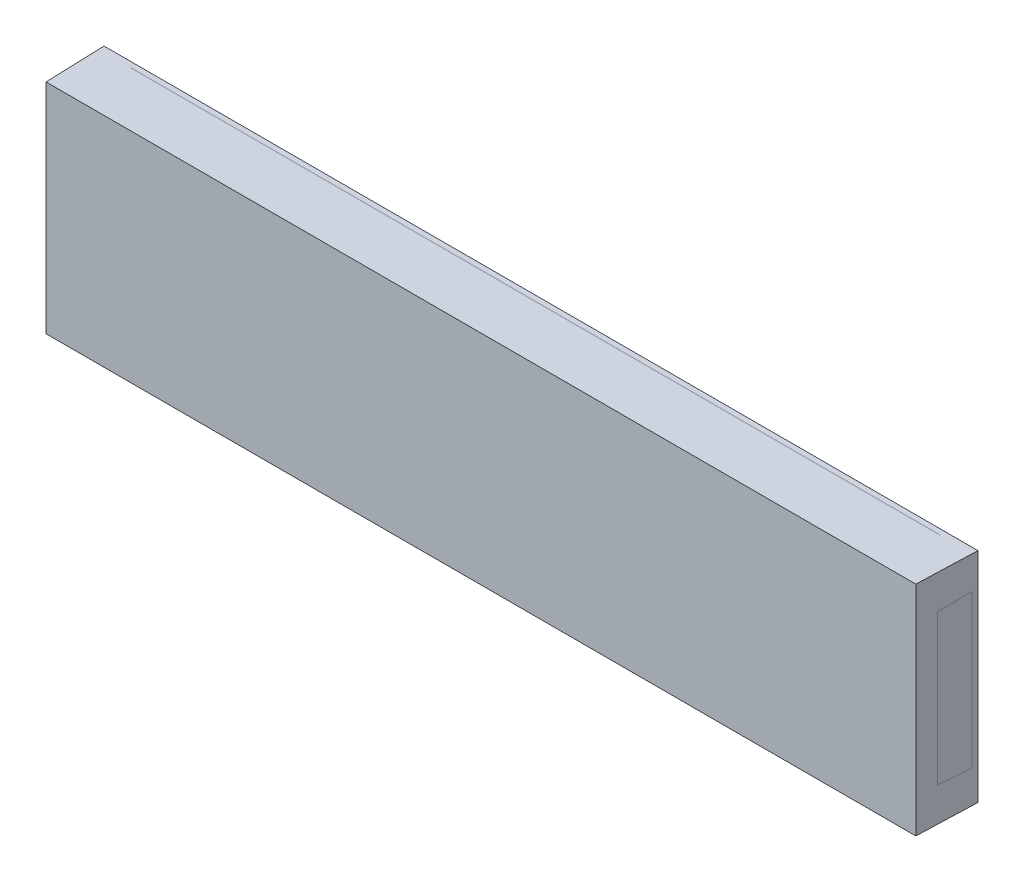
ISO-10303-21;
HEADER;
FILE_DESCRIPTION(('STEP AP214'),'2;1');
FILE_NAME('part.step','',(''),(''),'','','');
FILE_SCHEMA(('AUTOMOTIVE_DESIGN { 1 0 10303 214 1 1 1 1 }'));
ENDSEC;
DATA;
#1=APPLICATION_CONTEXT('core data for automotive mechanical design processes');
#2=APPLICATION_PROTOCOL_DEFINITION('international standard','automotive_design',2000,#1);
#3=PRODUCT_CONTEXT('',#1,'mechanical');
#4=PRODUCT('Part','Part','',(#3));
#5=PRODUCT_RELATED_PRODUCT_CATEGORY('part','',(#4));
#6=PRODUCT_DEFINITION_FORMATION('','',#4);
#7=PRODUCT_DEFINITION_CONTEXT('part definition',#1,'design');
#8=PRODUCT_DEFINITION('design','',#6,#7);
#9=PRODUCT_DEFINITION_SHAPE('','',#8);
#10=(LENGTH_UNIT() NAMED_UNIT(*) SI_UNIT(.MILLI.,.METRE.));
#11=(NAMED_UNIT(*) PLANE_ANGLE_UNIT() SI_UNIT($,.RADIAN.));
#12=(NAMED_UNIT(*) SI_UNIT($,.STERADIAN.) SOLID_ANGLE_UNIT());
#13=UNCERTAINTY_MEASURE_WITH_UNIT(LENGTH_MEASURE(1.E-05),#10,'distance_accuracy_value','');
#14=(GEOMETRIC_REPRESENTATION_CONTEXT(3) GLOBAL_UNCERTAINTY_ASSIGNED_CONTEXT((#13)) GLOBAL_UNIT_ASSIGNED_CONTEXT((#10,
#11,#12)) REPRESENTATION_CONTEXT('',''));
#15=CARTESIAN_POINT('',(0.,0.,0.));
#16=DIRECTION('',(0.,0.,1.));
#17=DIRECTION('',(1.,0.,0.));
#18=AXIS2_PLACEMENT_3D('',#15,#16,#17);
#19=CARTESIAN_POINT('',(40.,-10.,0.));
#20=DIRECTION('',(0.,0.,-1.));
#21=DIRECTION('',(-1.,0.,0.));
#22=AXIS2_PLACEMENT_3D('',#19,#20,#21);
#23=PLANE('',#22);
#24=DIRECTION('',(0.,-1.,0.));
#25=VECTOR('',#24,1.);
#26=CARTESIAN_POINT('',(40.0000009070112,9.98192948673217,0.));
#27=LINE('',#26,#25);
#28=CARTESIAN_POINT('',(40.0000009070112,9.98192948673217,0.));
#29=VERTEX_POINT('',#28);
#30=CARTESIAN_POINT('',(40.0000009070112,-9.98192980623829,0.));
#31=VERTEX_POINT('',#30);
#32=EDGE_CURVE('E150',#29,#31,#27,.T.);
#33=ORIENTED_EDGE('',*,*,#32,.T.);
#34=DIRECTION('',(-1.,0.,0.));
#35=VECTOR('',#34,1.);
#36=CARTESIAN_POINT('',(-40.0000005460726,-9.98192980623829,0.));
#37=LINE('',#36,#35);
#38=CARTESIAN_POINT('',(-40.0000005460726,-9.98192980623829,0.));
#39=VERTEX_POINT('',#38);
#40=EDGE_CURVE('E140',#31,#39,#37,.T.);
#41=ORIENTED_EDGE('',*,*,#40,.T.);
#42=DIRECTION('',(0.,-1.,0.));
#43=VECTOR('',#42,1.);
#44=CARTESIAN_POINT('',(-40.0000005460726,9.98192948673217,0.));
#45=LINE('',#44,#43);
#46=CARTESIAN_POINT('',(-40.0000005460726,9.98192948673217,0.));
#47=VERTEX_POINT('',#46);
#48=EDGE_CURVE('E136',#47,#39,#45,.T.);
#49=ORIENTED_EDGE('',*,*,#48,.F.);
#50=DIRECTION('',(-1.,0.,0.));
#51=VECTOR('',#50,1.);
#52=CARTESIAN_POINT('',(-40.0000005460726,9.98192948673217,0.));
#53=LINE('',#52,#51);
#54=EDGE_CURVE('E147',#29,#47,#53,.T.);
#55=ORIENTED_EDGE('',*,*,#54,.F.);
#56=EDGE_LOOP('',(#33,#41,#49,#55));
#57=FACE_BOUND('',#56,.T.);
#58=ADVANCED_FACE('F16',(#57),#23,.T.);
#59=CARTESIAN_POINT('',(40.0000009070112,9.98192948673217,0.));
#60=DIRECTION('',(-0.999390736977359,0.,-0.0349020750651221));
#61=DIRECTION('',(-0.0349020750651221,0.,0.999390736977359));
#62=AXIS2_PLACEMENT_3D('',#59,#60,#61);
#63=PLANE('',#62);
#64=DIRECTION('',(0.,-1.,0.));
#65=VECTOR('',#64,1.);
#66=CARTESIAN_POINT('',(39.8079224678627,9.98192948673217,5.5));
#67=LINE('',#66,#65);
#68=CARTESIAN_POINT('',(39.8079224678627,9.98192948673217,5.5));
#69=VERTEX_POINT('',#68);
#70=CARTESIAN_POINT('',(39.8079224678627,-9.98192980623829,5.5));
#71=VERTEX_POINT('',#70);
#72=EDGE_CURVE('E121',#69,#71,#67,.T.);
#73=ORIENTED_EDGE('',*,*,#72,.T.);
#74=DIRECTION('',(0.0349020750651221,0.,-0.999390736977359));
#75=VECTOR('',#74,1.);
#76=CARTESIAN_POINT('',(40.0000009070112,-9.98192980623829,0.));
#77=LINE('',#76,#75);
#78=EDGE_CURVE('E131',#71,#31,#77,.T.);
#79=ORIENTED_EDGE('',*,*,#78,.T.);
#80=ORIENTED_EDGE('',*,*,#32,.F.);
#81=DIRECTION('',(0.0349020750651221,0.,-0.999390736977359));
#82=VECTOR('',#81,1.);
#83=CARTESIAN_POINT('',(40.0000009070112,9.98192948673217,0.));
#84=LINE('',#83,#82);
#85=EDGE_CURVE('E145',#69,#29,#84,.T.);
#86=ORIENTED_EDGE('',*,*,#85,.F.);
#87=EDGE_LOOP('',(#73,#79,#80,#86));
#88=FACE_BOUND('',#87,.T.);
#89=DIRECTION('',(-0.0348782627420508,-0.0348782630061542,0.998782765949518));
#90=VECTOR('',#89,1.);
#91=CARTESIAN_POINT('',(39.9819302566142,6.983757775551,0.517449748351254));
#92=LINE('',#91,#90);
#93=CARTESIAN_POINT('',(39.9819298275343,6.98375777555006,0.517449733367464));
#94=VERTEX_POINT('',#93);
#95=CARTESIAN_POINT('',(39.8753315689852,6.87716738913,3.56979868319547));
#96=VERTEX_POINT('',#95);
#97=EDGE_CURVE('E310',#94,#96,#92,.T.);
#98=ORIENTED_EDGE('',*,*,#97,.F.);
#99=DIRECTION('',(0.,1.,0.));
#100=VECTOR('',#99,1.);
#101=CARTESIAN_POINT('',(39.9819302566096,-7.143998569056,0.51744974835109));
#102=LINE('',#101,#100);
#103=CARTESIAN_POINT('',(39.9819299970502,-6.98375777554963,0.517451030040159));
#104=VERTEX_POINT('',#103);
#105=EDGE_CURVE('E448',#94,#104,#102,.F.);
#106=ORIENTED_EDGE('',*,*,#105,.T.);
#107=DIRECTION('',(0.0348782627423749,-0.0348782627423707,-0.998782765958718));
#108=VECTOR('',#107,1.);
#109=CARTESIAN_POINT('',(39.8753398722184,-6.87716739116146,3.5697989934351));
#110=LINE('',#109,#108);
#111=CARTESIAN_POINT('',(39.8753315687993,-6.87716738945503,3.56979868320406));
#112=VERTEX_POINT('',#111);
#113=EDGE_CURVE('E298',#104,#112,#110,.F.);
#114=ORIENTED_EDGE('',*,*,#113,.T.);
#115=DIRECTION('',(0.,1.,0.));
#116=VECTOR('',#115,1.);
#117=CARTESIAN_POINT('',(39.8753398722194,-12.05849268302,3.56979899340661));
#118=LINE('',#117,#116);
#119=EDGE_CURVE('E302',#96,#112,#118,.F.);
#120=ORIENTED_EDGE('',*,*,#119,.F.);
#121=EDGE_LOOP('',(#98,#106,#114,#120));
#122=FACE_BOUND('',#121,.T.);
#123=ADVANCED_FACE('F180',(#88,#122),#63,.F.);
#124=CARTESIAN_POINT('',(-40.0000005460726,9.98192948673217,0.));
#125=DIRECTION('',(0.999390740500121,0.,-0.0349019741937438));
#126=DIRECTION('',(-0.0349019741937438,0.,-0.999390740500121));
#127=AXIS2_PLACEMENT_3D('',#124,#125,#126);
#128=PLANE('',#127);
#129=ORIENTED_EDGE('',*,*,#48,.T.);
#130=DIRECTION('',(0.0349019741937438,0.,0.999390740500121));
#131=VECTOR('',#130,1.);
#132=CARTESIAN_POINT('',(-40.0000005460726,-9.98192980623829,0.));
#133=LINE('',#132,#131);
#134=CARTESIAN_POINT('',(-39.8079226627318,-9.98192980623829,5.5));
#135=VERTEX_POINT('',#134);
#136=EDGE_CURVE('E128',#39,#135,#133,.T.);
#137=ORIENTED_EDGE('',*,*,#136,.T.);
#138=DIRECTION('',(0.,-1.,0.));
#139=VECTOR('',#138,1.);
#140=CARTESIAN_POINT('',(-39.8079226627318,9.98192948673217,5.5));
#141=LINE('',#140,#139);
#142=CARTESIAN_POINT('',(-39.8079226627318,9.98192948673217,5.5));
#143=VERTEX_POINT('',#142);
#144=EDGE_CURVE('E111',#143,#135,#141,.T.);
#145=ORIENTED_EDGE('',*,*,#144,.F.);
#146=DIRECTION('',(0.0349019741937438,0.,0.999390740500121));
#147=VECTOR('',#146,1.);
#148=CARTESIAN_POINT('',(-40.0000005460726,9.98192948673217,0.));
#149=LINE('',#148,#147);
#150=EDGE_CURVE('E142',#47,#143,#149,.T.);
#151=ORIENTED_EDGE('',*,*,#150,.F.);
#152=EDGE_LOOP('',(#129,#137,#145,#151));
#153=FACE_BOUND('',#152,.T.);
#154=DIRECTION('',(0.034878262742053,0.0348782630061543,0.998782765949518));
#155=VECTOR('',#154,1.);
#156=CARTESIAN_POINT('',(-39.9819302566142,-6.98375777555101,0.517449748351046));
#157=LINE('',#156,#155);
#158=CARTESIAN_POINT('',(-39.9819298990477,-6.98375777555227,0.517449735864835));
#159=VERTEX_POINT('',#158);
#160=CARTESIAN_POINT('',(-39.8753315689887,-6.87716738929246,3.56979868320128));
#161=VERTEX_POINT('',#160);
#162=EDGE_CURVE('E301',#159,#161,#157,.T.);
#163=ORIENTED_EDGE('',*,*,#162,.F.);
#164=DIRECTION('',(0.,-1.,0.));
#165=VECTOR('',#164,1.);
#166=CARTESIAN_POINT('',(-39.9819302566096,7.143998569056,0.51744974835109));
#167=LINE('',#166,#165);
#168=CARTESIAN_POINT('',(-39.9819298446761,6.98375777554657,0.517450974221577));
#169=VERTEX_POINT('',#168);
#170=EDGE_CURVE('E269',#159,#169,#167,.F.);
#171=ORIENTED_EDGE('',*,*,#170,.T.);
#172=DIRECTION('',(0.0348782627423707,-0.0348782627423707,0.998782765958719));
#173=VECTOR('',#172,1.);
#174=CARTESIAN_POINT('',(-40.0041157861973,7.00594330513268,-0.117860695936495));
#175=LINE('',#174,#173);
#176=CARTESIAN_POINT('',(-39.8753315687961,6.87716738923162,3.56979868319541));
#177=VERTEX_POINT('',#176);
#178=EDGE_CURVE('E207',#169,#177,#175,.T.);
#179=ORIENTED_EDGE('',*,*,#178,.T.);
#180=DIRECTION('',(0.,1.,0.));
#181=VECTOR('',#180,1.);
#182=CARTESIAN_POINT('',(-39.8753398722194,-11.05849268302,3.56979899340661));
#183=LINE('',#182,#181);
#184=EDGE_CURVE('E306',#161,#177,#183,.T.);
#185=ORIENTED_EDGE('',*,*,#184,.F.);
#186=EDGE_LOOP('',(#163,#171,#179,#185));
#187=FACE_BOUND('',#186,.T.);
#188=ADVANCED_FACE('F133',(#153,#187),#128,.F.);
#189=CARTESIAN_POINT('',(-39.8079226627318,-9.98192980623829,5.5));
#190=DIRECTION('',(0.,1.,0.));
#191=DIRECTION('',(0.,0.,1.));
#192=AXIS2_PLACEMENT_3D('',#189,#190,#191);
#193=PLANE('',#192);
#194=ORIENTED_EDGE('',*,*,#136,.F.);
#195=ORIENTED_EDGE('',*,*,#40,.F.);
#196=ORIENTED_EDGE('',*,*,#78,.F.);
#197=DIRECTION('',(1.,0.,0.));
#198=VECTOR('',#197,1.);
#199=CARTESIAN_POINT('',(-39.8079226627318,-9.98192980623829,5.5));
#200=LINE('',#199,#198);
#201=EDGE_CURVE('E114',#135,#71,#200,.T.);
#202=ORIENTED_EDGE('',*,*,#201,.F.);
#203=EDGE_LOOP('',(#194,#195,#196,#202));
#204=FACE_BOUND('',#203,.T.);
#205=CARTESIAN_POINT('',(36.98375777556,-9.482234843105,0.5));
#206=DIRECTION('',(1.,0.,0.));
#207=DIRECTION('',(0.,0.,-1.));
#208=AXIS2_PLACEMENT_3D('',#205,#206,#207);
#209=CIRCLE('',#208,0.5);
#210=CARTESIAN_POINT('',(36.98375777556,-9.98192980623829,0.482537359328566));
#211=VERTEX_POINT('',#210);
#212=CARTESIAN_POINT('',(36.9837577755424,-9.98192980623829,0.482601995474424));
#213=VERTEX_POINT('',#212);
#214=EDGE_CURVE('E214',#211,#213,#209,.F.);
#215=ORIENTED_EDGE('',*,*,#214,.F.);
#216=DIRECTION('',(1.,0.,0.));
#217=VECTOR('',#216,1.);
#218=CARTESIAN_POINT('',(-37.13223918574,-9.98192980623829,0.482537359328566));
#219=LINE('',#218,#217);
#220=CARTESIAN_POINT('',(-36.9837577755419,-9.98192980623828,0.482603656701612));
#221=VERTEX_POINT('',#220);
#222=EDGE_CURVE('E42',#221,#211,#219,.T.);
#223=ORIENTED_EDGE('',*,*,#222,.F.);
#224=CARTESIAN_POINT('',(-36.9837577755416,-9.9819298062383,0.517396343296493));
#225=CARTESIAN_POINT('',(-36.9879536992052,-9.981929806239,0.517359145028784));
#226=CARTESIAN_POINT('',(-36.9921880439902,-9.98192980623865,0.517132366181378));
#227=CARTESIAN_POINT('',(-37.0008153292392,-9.98192980623791,0.516066643000893));
#228=CARTESIAN_POINT('',(-37.0052038753618,-9.98192980623751,0.515194134539367));
#229=CARTESIAN_POINT('',(-37.0115480550821,-9.98192980623867,0.513229748609068));
#230=CARTESIAN_POINT('',(-37.0136044809461,-9.98192980623934,0.512475891201816));
#231=CARTESIAN_POINT('',(-37.0175596918098,-9.98192980623725,0.510667678451077));
#232=CARTESIAN_POINT('',(-37.0194601302562,-9.98192980623452,0.509617209916807));
#233=CARTESIAN_POINT('',(-37.0224598498217,-9.98192980623985,0.507368973921456));
#234=CARTESIAN_POINT('',(-37.0236369466024,-9.98192980624519,0.506287412802017));
#235=CARTESIAN_POINT('',(-37.0251556833245,-9.98192980623401,0.504223579317234));
#236=CARTESIAN_POINT('',(-37.0256448520456,-9.98192980622502,0.50335940997722));
#237=CARTESIAN_POINT('',(-37.0262352371623,-9.9819298062257,0.50164715647342));
#238=CARTESIAN_POINT('',(-37.0263847322471,-9.98192980623271,0.500817232723045));
#239=CARTESIAN_POINT('',(-37.0263818449234,-9.98192980623925,0.499156876247959));
#240=CARTESIAN_POINT('',(-37.026229056984,-9.98192980623878,0.498326444335675));
#241=CARTESIAN_POINT('',(-37.0256044028967,-9.98192980623597,0.496534705696169));
#242=CARTESIAN_POINT('',(-37.0250543108819,-9.98192980623315,0.495603108580127));
#243=CARTESIAN_POINT('',(-37.0233386075342,-9.98192980623134,0.493381512215582));
#244=CARTESIAN_POINT('',(-37.0220036320313,-9.98192980623592,0.492236321463049));
#245=CARTESIAN_POINT('',(-37.0176648973259,-9.98192980624313,0.489193110897724));
#246=CARTESIAN_POINT('',(-37.0143744995123,-9.98192980623872,0.487758103644763));
#247=CARTESIAN_POINT('',(-37.0071670633342,-9.98192980623776,0.485331320538807));
#248=CARTESIAN_POINT('',(-37.003226272153,-9.98192980624237,0.484428221094408));
#249=CARTESIAN_POINT('',(-36.9952565396089,-9.98192980623421,0.483159181494896));
#250=CARTESIAN_POINT('',(-36.9912275770333,-9.98192980622142,0.482793372077379));
#251=CARTESIAN_POINT('',(-36.9860490908079,-9.98192980622947,0.482623252648921));
#252=CARTESIAN_POINT('',(-36.9849031343206,-9.98192980623279,0.482604446408487));
#253=CARTESIAN_POINT('',(-36.9837577755419,-9.98192980623828,0.482603656701612));
#254=B_SPLINE_CURVE_WITH_KNOTS('',3,(#224,#225,#226,#227,#228,#229,#230,#231,#232,#233,#234,
#235,#236,#237,#238,#239,#240,#241,#242,#243,#244,#245,#246,#247,#248,#249,#250,#251,#252,#253),
.UNSPECIFIED.,.F.,.F.,(4,2,2,2,2,2,2,2,2,2,2,2,2,2,4),(0.,0.0126506526769451,0.026009613400871,
0.0325651144022979,0.0390384090145389,0.0437652146901737,0.0466980901597976,0.0491776303123396,
0.0516604991735108,0.0548477645750427,0.0600463293828571,0.0706746747000172,0.0827720380602645,
0.0948723445578345,0.0983097796420737),.UNSPECIFIED.);
#255=CARTESIAN_POINT('',(-36.9837575503598,-9.98192980623829,0.517446068710582));
#256=VERTEX_POINT('',#255);
#257=EDGE_CURVE('E11',#256,#221,#254,.T.);
#258=ORIENTED_EDGE('',*,*,#257,.F.);
#259=CARTESIAN_POINT('',(-36.9837577755472,-9.98192980623829,0.51746264543171));
#260=DIRECTION('',(1.,0.,0.));
#261=VECTOR('',#260,1.);
#262=LINE('',#259,#261);
#263=CARTESIAN_POINT('',(36.9837577755777,-9.98192980623829,0.517446484019595));
#264=VERTEX_POINT('',#263);
#265=EDGE_CURVE('E267',#256,#264,#262,.T.);
#266=ORIENTED_EDGE('',*,*,#265,.T.);
#267=CARTESIAN_POINT('',(36.9837577755424,-9.98192980623829,0.482601995474424));
#268=CARTESIAN_POINT('',(36.9879539585459,-9.98192980623906,0.482639314473691));
#269=CARTESIAN_POINT('',(36.9921885707566,-9.98192980623869,0.482866214058226));
#270=CARTESIAN_POINT('',(37.0008165048204,-9.98192980623787,0.48393224767878));
#271=CARTESIAN_POINT('',(37.0052054287384,-9.98192980623743,0.484804966313812));
#272=CARTESIAN_POINT('',(37.0115500938721,-9.98192980623871,0.486769781695058));
#273=CARTESIAN_POINT('',(37.0136066613852,-9.98192980623945,0.487523796197029));
#274=CARTESIAN_POINT('',(37.0175620968247,-9.98192980623714,0.489332382959601));
#275=CARTESIAN_POINT('',(37.0194626198199,-9.98192980623415,0.490383064902244));
#276=CARTESIAN_POINT('',(37.0224619927173,-9.98192980623993,0.492631509829533));
#277=CARTESIAN_POINT('',(37.0236387462876,-9.98192980624575,0.493712966407927));
#278=CARTESIAN_POINT('',(37.0251572036248,-9.98192980623366,0.495776712557232));
#279=CARTESIAN_POINT('',(37.0256463410093,-9.98192980622391,0.496640990976075));
#280=CARTESIAN_POINT('',(37.0262366052754,-9.98192980622469,0.498353417722306));
#281=CARTESIAN_POINT('',(37.0263860241147,-9.98192980623231,0.499183406232864));
#282=CARTESIAN_POINT('',(37.0263829772391,-9.98192980623935,0.50084385834695));
#283=CARTESIAN_POINT('',(37.0262301067085,-9.98192980623875,0.501674321096648));
#284=CARTESIAN_POINT('',(37.0256052451333,-9.98192980623603,0.503466232856195));
#285=CARTESIAN_POINT('',(37.0250549879647,-9.98192980623351,0.504397950266438));
#286=CARTESIAN_POINT('',(37.0233387759446,-9.98192980623196,0.506619890786136));
#287=CARTESIAN_POINT('',(37.022003417162,-9.98192980623612,0.507765249963665));
#288=CARTESIAN_POINT('',(37.0176633634804,-9.98192980624273,0.510808970744666));
#289=CARTESIAN_POINT('',(37.0143719753573,-9.98192980623884,0.512244164551787));
#290=CARTESIAN_POINT('',(37.0071624541636,-9.98192980623765,0.514671157967108));
#291=CARTESIAN_POINT('',(37.0032205696114,-9.98192980624133,0.515574264463217));
#292=CARTESIAN_POINT('',(36.9952486608407,-9.98192980623525,0.516843143012467));
#293=CARTESIAN_POINT('',(36.9912186156419,-9.98192980622548,0.517208785717119));
#294=CARTESIAN_POINT('',(36.9860424088419,-9.9819298062316,0.517378461070729));
#295=CARTESIAN_POINT('',(36.9848997955068,-9.98192980623412,0.517397188669165));
#296=CARTESIAN_POINT('',(36.9837577755423,-9.98192980623828,0.517398004525621));
#297=B_SPLINE_CURVE_WITH_KNOTS('',3,(#267,#268,#269,#270,#271,#272,#273,#274,#275,#276,#277,
#278,#279,#280,#281,#282,#283,#284,#285,#286,#287,#288,#289,#290,#291,#292,#293,#294,#295,#296),
.UNSPECIFIED.,.F.,.F.,(4,2,2,2,2,2,2,2,2,2,2,2,2,2,4),(0.,0.0126514582531855,0.0260116359008564,
0.0325676974934914,0.0390414895645643,0.0437673594863788,0.0467004601114489,0.0491801469257807,
0.0516631567025663,0.0548509759716014,0.0600507283915511,0.0706819855851187,0.0827825448207556,
0.0948860157556726,0.098313426861432),.UNSPECIFIED.);
#298=EDGE_CURVE('E450',#213,#264,#297,.T.);
#299=ORIENTED_EDGE('',*,*,#298,.F.);
#300=EDGE_LOOP('',(#215,#223,#258,#266,#299));
#301=FACE_BOUND('',#300,.T.);
#302=ADVANCED_FACE('F126',(#204,#301),#193,.F.);
#303=CARTESIAN_POINT('',(-39.8079226627318,9.98192948673217,5.5));
#304=DIRECTION('',(0.,1.,0.));
#305=DIRECTION('',(0.,0.,1.));
#306=AXIS2_PLACEMENT_3D('',#303,#304,#305);
#307=PLANE('',#306);
#308=DIRECTION('',(-1.,0.,0.));
#309=VECTOR('',#308,1.);
#310=CARTESIAN_POINT('',(37.14399856906,9.98192948673217,0.482528219028539));
#311=LINE('',#310,#309);
#312=CARTESIAN_POINT('',(-36.9837577755424,9.98192948673216,0.482592821187906));
#313=VERTEX_POINT('',#312);
#314=CARTESIAN_POINT('',(36.98375777555,9.98192948673217,0.482528219028539));
#315=VERTEX_POINT('',#314);
#316=EDGE_CURVE('E120',#313,#315,#311,.F.);
#317=ORIENTED_EDGE('',*,*,#316,.T.);
#318=CARTESIAN_POINT('',(36.9837577755419,9.98192948673217,0.482594481539302));
#319=CARTESIAN_POINT('',(36.9879570931712,9.98192948673295,0.482631767339016));
#320=CARTESIAN_POINT('',(36.9921949652236,9.98192948673257,0.482858768216633));
#321=CARTESIAN_POINT('',(37.0008306371648,9.98192948673175,0.483925826246428));
#322=CARTESIAN_POINT('',(37.0052240121718,9.9819294867313,0.484799671681216));
#323=CARTESIAN_POINT('',(37.0115746804303,9.9819294867326,0.486767402064617));
#324=CARTESIAN_POINT('',(37.0136330637292,9.98192948673334,0.487522543976));
#325=CARTESIAN_POINT('',(37.0175916335043,9.98192948673102,0.489334014879392));
#326=CARTESIAN_POINT('',(37.0194934895111,9.981929486728,0.490386419868195));
#327=CARTESIAN_POINT('',(37.0224903113036,9.98192948673381,0.492636256539395));
#328=CARTESIAN_POINT('',(37.023664034119,9.98192948673963,0.493716347714592));
#329=CARTESIAN_POINT('',(37.0251802819764,9.98192948672753,0.495778617013087));
#330=CARTESIAN_POINT('',(37.0256693039186,9.98192948671774,0.496643611530589));
#331=CARTESIAN_POINT('',(37.0262588335264,9.98192948671853,0.498357059775255));
#332=CARTESIAN_POINT('',(37.0264077765049,9.98192948672619,0.499187333658448));
#333=CARTESIAN_POINT('',(37.0264037750787,9.98192948673324,0.500848154025929));
#334=CARTESIAN_POINT('',(37.0262504302047,9.98192948673263,0.501678699412443));
#335=CARTESIAN_POINT('',(37.0256244064379,9.98192948672989,0.503471429270261));
#336=CARTESIAN_POINT('',(37.0250732301796,9.98192948672737,0.50440375434129));
#337=CARTESIAN_POINT('',(37.0233541980745,9.98192948672582,0.506627468630404));
#338=CARTESIAN_POINT('',(37.0220167254179,9.98192948673,0.507773684173941));
#339=CARTESIAN_POINT('',(37.0176694082882,9.98192948673662,0.510820012446086));
#340=CARTESIAN_POINT('',(37.0143725902835,9.98192948673271,0.512256103412539));
#341=CARTESIAN_POINT('',(37.007151690647,9.98192948673154,0.514683967681106));
#342=CARTESIAN_POINT('',(37.0032038694638,9.98192948673527,0.515586962687655));
#343=CARTESIAN_POINT('',(36.9952201589774,9.98192948672907,0.516854673162532));
#344=CARTESIAN_POINT('',(36.9911842497262,9.98192948671912,0.51721926539545));
#345=CARTESIAN_POINT('',(36.9860156635712,9.98192948672544,0.517386493167421));
#346=CARTESIAN_POINT('',(36.9848864304065,9.98192948672799,0.517404752554096));
#347=CARTESIAN_POINT('',(36.9837577755416,9.98192948673217,0.517405518460104));
#348=B_SPLINE_CURVE_WITH_KNOTS('',3,(#318,#319,#320,#321,#322,#323,#324,#325,#326,#327,#328,
#329,#330,#331,#332,#333,#334,#335,#336,#337,#338,#339,#340,#341,#342,#343,#344,#345,#346,#347),
.UNSPECIFIED.,.F.,.F.,(4,2,2,2,2,2,2,2,2,2,2,2,2,2,4),(0.,0.0126610795315291,0.0260348213120136,
0.032597157232864,0.0390766200209724,0.0437933789381701,0.0467280762246484,0.0492083368639719,
0.0516918855484976,0.0548826311339772,0.060088795113289,0.0707358706860866,0.0828536803433473,
0.0949742632253597,0.0983615482325402),.UNSPECIFIED.);
#349=CARTESIAN_POINT('',(36.9837577755472,9.98192948673217,0.51747179488987));
#350=VERTEX_POINT('',#349);
#351=EDGE_CURVE('E34',#315,#350,#348,.T.);
#352=ORIENTED_EDGE('',*,*,#351,.T.);
#353=CARTESIAN_POINT('',(36.9837577755473,9.98192948673217,0.517471794889869));
#354=DIRECTION('',(-1.,0.,0.));
#355=VECTOR('',#354,1.);
#356=LINE('',#353,#355);
#357=CARTESIAN_POINT('',(-36.9837577755508,9.98192950598755,0.517449722138992));
#358=VERTEX_POINT('',#357);
#359=EDGE_CURVE('E155',#350,#358,#356,.T.);
#360=ORIENTED_EDGE('',*,*,#359,.T.);
#361=CARTESIAN_POINT('',(-36.9837577755423,9.98192948673218,0.517407178811217));
#362=CARTESIAN_POINT('',(-36.9879573519866,9.98192948673288,0.517369772257523));
#363=CARTESIAN_POINT('',(-36.9921954909325,9.98192948673253,0.517142650653404));
#364=CARTESIAN_POINT('',(-37.0008318108677,9.98192948673178,0.516075282255824));
#365=CARTESIAN_POINT('',(-37.0052255633693,9.98192948673138,0.515201226662739));
#366=CARTESIAN_POINT('',(-37.0115767165227,9.98192948673256,0.513233066842887));
#367=CARTESIAN_POINT('',(-37.0136352412826,9.98192948673323,0.512477767851276));
#368=CARTESIAN_POINT('',(-37.0175940351409,9.98192948673112,0.510665922890833));
#369=CARTESIAN_POINT('',(-37.0194959753989,9.98192948672838,0.50961330444566));
#370=CARTESIAN_POINT('',(-37.0224924515466,9.98192948673372,0.507363258469834));
#371=CARTESIAN_POINT('',(-37.0236658326426,9.98192948673906,0.506283271274196));
#372=CARTESIAN_POINT('',(-37.0251818012299,9.98192948672788,0.504221088410121));
#373=CARTESIAN_POINT('',(-37.0256707911747,9.98192948671885,0.503355985141828));
#374=CARTESIAN_POINT('',(-37.026260199364,9.98192948671955,0.501642364073508));
#375=CARTESIAN_POINT('',(-37.0264090659782,9.98192948672659,0.500812025408089));
#376=CARTESIAN_POINT('',(-37.026404904679,9.98192948673316,0.499151109392121));
#377=CARTESIAN_POINT('',(-37.0262514770098,9.98192948673268,0.498320533179732));
#378=CARTESIAN_POINT('',(-37.0256252451311,9.98192948672985,0.496527630001658));
#379=CARTESIAN_POINT('',(-37.0250739032548,9.98192948672699,0.495595184508651));
#380=CARTESIAN_POINT('',(-37.0233543608862,9.98192948672517,0.493371125543964));
#381=CARTESIAN_POINT('',(-37.0220165037042,9.98192948672979,0.492224741409792));
#382=CARTESIAN_POINT('',(-37.0176678631584,9.98192948673705,0.489177902276034));
#383=CARTESIAN_POINT('',(-37.0143700516282,9.9819294867326,0.487741624755838));
#384=CARTESIAN_POINT('',(-37.0071470610868,9.98192948673167,0.485313551149949));
#385=CARTESIAN_POINT('',(-37.0031981439085,9.98192948673638,0.484410549970613));
#386=CARTESIAN_POINT('',(-36.9952122521283,9.98192948672796,0.48314300265073));
#387=CARTESIAN_POINT('',(-36.9911752578113,9.98192948671483,0.482778578345376));
#388=CARTESIAN_POINT('',(-36.98600895982,9.98192948672327,0.482611794294538));
#389=CARTESIAN_POINT('',(-36.984883080661,9.98192948672664,0.482593612784196));
#390=CARTESIAN_POINT('',(-36.9837577755424,9.98192948673216,0.482592821187906));
#391=B_SPLINE_CURVE_WITH_KNOTS('',3,(#361,#362,#363,#364,#365,#366,#367,#368,#369,#370,#371,
#372,#373,#374,#375,#376,#377,#378,#379,#380,#381,#382,#383,#384,#385,#386,#387,#388,#389,#390),
.UNSPECIFIED.,.F.,.F.,(4,2,2,2,2,2,2,2,2,2,2,2,2,2,4),(0.,0.0126618835307479,0.0260368413616282,
0.0325997373865399,0.0390796970891766,0.043795524618347,0.046730445418885,0.049210852909645,
0.0516945427078043,0.0548858433218759,0.0600931981966924,0.0707431947111064,0.0828642076266441,
0.0949879621007098,0.0983651904058236),.UNSPECIFIED.);
#392=EDGE_CURVE('E27',#358,#313,#391,.T.);
#393=ORIENTED_EDGE('',*,*,#392,.T.);
#394=EDGE_LOOP('',(#317,#352,#360,#393));
#395=FACE_BOUND('',#394,.T.);
#396=ORIENTED_EDGE('',*,*,#150,.T.);
#397=DIRECTION('',(1.,0.,0.));
#398=VECTOR('',#397,1.);
#399=CARTESIAN_POINT('',(-39.8079226627318,9.98192948673217,5.5));
#400=LINE('',#399,#398);
#401=EDGE_CURVE('E115',#143,#69,#400,.T.);
#402=ORIENTED_EDGE('',*,*,#401,.T.);
#403=ORIENTED_EDGE('',*,*,#85,.T.);
#404=ORIENTED_EDGE('',*,*,#54,.T.);
#405=EDGE_LOOP('',(#396,#402,#403,#404));
#406=FACE_BOUND('',#405,.T.);
#407=ADVANCED_FACE('F173',(#395,#406),#307,.T.);
#408=CARTESIAN_POINT('',(39.98162407807,6.983757775532,0.5246626595471));
#409=CARTESIAN_POINT('',(39.9816232940301,7.058275936679,0.5246626595471));
#410=CARTESIAN_POINT('',(39.97326970876,7.282705740783,0.5246626595471));
#411=CARTESIAN_POINT('',(39.91378300753,7.67781471594,0.5246626595471));
#412=CARTESIAN_POINT('',(39.75561872757,8.169096930731,0.5246626595471));
#413=CARTESIAN_POINT('',(39.48789734512,8.666534669068,0.5246626595471));
#414=CARTESIAN_POINT('',(39.11362925542,9.12175479864201,0.5246626595471));
#415=CARTESIAN_POINT('',(38.65696625034,9.49430369452901,0.5246626595471));
#416=CARTESIAN_POINT('',(38.15844381734,9.760153783113,0.5246626595471));
#417=CARTESIAN_POINT('',(37.66646862407,9.91645116526501,0.5246626595471));
#418=CARTESIAN_POINT('',(37.27493381016,9.97384436074499,0.5246626595471));
#419=CARTESIAN_POINT('',(37.05437809806,9.981623445968,0.5246626595471));
#420=CARTESIAN_POINT('',(36.98375777554,9.981623913615,0.5246626595471));
#421=CARTESIAN_POINT('',(39.99664286116,6.983757775645,0.2205488691831));
#422=CARTESIAN_POINT('',(39.99664207331,7.058648881089,0.2205488691831));
#423=CARTESIAN_POINT('',(39.98824667508,7.284202025833,0.2205488691831));
#424=CARTESIAN_POINT('',(39.92846215988,7.681289320964,0.2205488691831));
#425=CARTESIAN_POINT('',(39.7695056402,8.175032509807,0.2205488691831));
#426=CARTESIAN_POINT('',(39.50044268604,8.674963039632,0.2205488691831));
#427=CARTESIAN_POINT('',(39.12429863937,9.132464912435,0.2205488691831));
#428=CARTESIAN_POINT('',(38.66534666377,9.50688114318101,0.2205488691831));
#429=CARTESIAN_POINT('',(38.16432601995,9.774063416614,0.2205488691831));
#430=CARTESIAN_POINT('',(37.66988640528,9.931143679178,0.2205488691831));
#431=CARTESIAN_POINT('',(37.27639118992,9.988824202348,0.2205488691831));
#432=CARTESIAN_POINT('',(37.05473153474,9.99664222655199,0.2205488691831));
#433=CARTESIAN_POINT('',(36.98375777562,9.996642696636,0.2205488691831));
#434=CARTESIAN_POINT('',(39.78671702231,6.983757774064,-1.197656860242E-07));
#435=CARTESIAN_POINT('',(39.78671628767,7.053436030781,-1.197656860376E-07));
#436=CARTESIAN_POINT('',(39.77890533236,7.263287622026,-1.197656859118E-07));
#437=CARTESIAN_POINT('',(39.72328352768,7.632722844575,-1.197656855212E-07));
#438=CARTESIAN_POINT('',(39.57540058084,8.092067637818,-1.197656876763E-07));
#439=CARTESIAN_POINT('',(39.32508951665,8.55715504213999,-1.197656793224E-07));
#440=CARTESIAN_POINT('',(38.9751667582,8.982763727694,-1.197656894101E-07));
#441=CARTESIAN_POINT('',(38.54820898967,9.331079186195,-1.197656839894E-07));
#442=CARTESIAN_POINT('',(38.08210722042,9.579640775103,-1.197656905203E-07));
#443=CARTESIAN_POINT('',(37.62211418681,9.7257782851,-1.197656860289E-07));
#444=CARTESIAN_POINT('',(37.25602058681,9.779442670216,-1.197656834486E-07));
#445=CARTESIAN_POINT('',(37.0497913548,9.786716422732,-1.197656857066E-07));
#446=CARTESIAN_POINT('',(36.98375777453,9.78671685876701,-1.197656860242E-07));
#447=CARTESIAN_POINT('',(39.48223276622,6.983757771771,0.));
#448=CARTESIAN_POINT('',(39.48223210874,7.045875118524,0.));
#449=CARTESIAN_POINT('',(39.47526885124,7.232952591715,0.));
#450=CARTESIAN_POINT('',(39.42568479694,7.562280218191,0.));
#451=CARTESIAN_POINT('',(39.29386337262,7.971732297168,0.));
#452=CARTESIAN_POINT('',(39.07075074811,8.386281934405,0.));
#453=CARTESIAN_POINT('',(38.75886032281,8.765631553201,0.));
#454=CARTESIAN_POINT('',(38.37830814396,9.076089479423,0.));
#455=CARTESIAN_POINT('',(37.96285401107,9.29764293390299,0.));
#456=CARTESIAN_POINT('',(37.5528235817,9.42790866797401,0.));
#457=CARTESIAN_POINT('',(37.22647430528,9.475747896863,0.));
#458=CARTESIAN_POINT('',(37.0426259338,9.482232217449,0.));
#459=CARTESIAN_POINT('',(36.98375777296,9.48223260409699,0.));
#460=(BOUNDED_SURFACE() B_SPLINE_SURFACE(3,3,((#408,#409,#410,#411,#412,#413,#414,#415,#416,
#417,#418,#419,#420),(#421,#422,#423,#424,#425,#426,#427,#428,#429,#430,#431,#432,#433),(#434,
#435,#436,#437,#438,#439,#440,#441,#442,#443,#444,#445,#446),(#447,#448,#449,#450,#451,#452,
#453,#454,#455,#456,#457,#458,#459)),.UNSPECIFIED.,.F.,.F.,.F.) B_SPLINE_SURFACE_WITH_KNOTS((4,
4),(4,1,1,1,1,1,1,1,1,1,4),(0.,1.),(0.026212526966,0.07112423364884,0.1614390895722,
0.2662443421778,0.3807277548087,0.4999627858997,0.6192043244615,0.7337038470695,0.8385294243825,
0.9288633410153,0.9714247919179),
.UNSPECIFIED.) GEOMETRIC_REPRESENTATION_ITEM() RATIONAL_B_SPLINE_SURFACE(((1.183819331831,
1.183819331831,1.183819331831,1.183819331831,1.183819331831,1.183819331831,1.183819331831,
1.183819331831,1.183819331831,1.183819331831,1.183819331831,1.183819331831,1.183819331831),
(0.9387268893896,0.9387268893896,0.9387268893896,0.9387268893896,0.9387268893896,
0.9387268893896,0.9387268893896,0.9387268893896,0.9387268893896,0.9387268893896,0.9387268893896,
0.9387268893896,0.9387268893896),(0.9387268893896,0.9387268893896,0.9387268893896,
0.9387268893896,0.9387268893896,0.9387268893896,0.9387268893896,0.9387268893896,0.9387268893896,
0.9387268893896,0.9387268893896,0.9387268893896,0.9387268893896),(1.183819331831,1.183819331831,
1.183819331831,1.183819331831,1.183819331831,1.183819331831,1.183819331831,1.183819331831,
1.183819331831,1.183819331831,1.183819331831,1.183819331831,1.183819331831))) REPRESENTATION_ITEM('') SURFACE());
#461=CARTESIAN_POINT('',(36.98375777296,9.48223260409699,0.));
#462=CARTESIAN_POINT('',(36.98375777453,9.78671685876701,-1.197656860242E-07));
#463=CARTESIAN_POINT('',(36.98375777562,9.996642696636,0.2205488691831));
#464=CARTESIAN_POINT('',(36.98375777554,9.981623913615,0.5246626595471));
#465=(BOUNDED_CURVE() B_SPLINE_CURVE(3,(#461,#462,#463,#464),.UNSPECIFIED.,.F.,
.F.) B_SPLINE_CURVE_WITH_KNOTS((4,4),(0.,1.),
.UNSPECIFIED.) CURVE() GEOMETRIC_REPRESENTATION_ITEM() RATIONAL_B_SPLINE_CURVE((1.183819331831,
0.9387268893896,0.9387268893896,1.183819331831)) REPRESENTATION_ITEM(''));
#466=EDGE_CURVE('E454',#315,#350,#465,.T.);
#467=ORIENTED_EDGE('',*,*,#351,.F.);
#468=ORIENTED_EDGE('',*,*,#466,.T.);
#469=EDGE_LOOP('',(#467,#468));
#470=FACE_BOUND('',#469,.T.);
#471=ADVANCED_FACE('F168',(#470),#460,.T.);
#472=CARTESIAN_POINT('',(-36.98375777554,9.98162397146099,0.524662659541));
#473=CARTESIAN_POINT('',(-37.05436737908,9.98162343736299,0.524662659541));
#474=CARTESIAN_POINT('',(-37.27491436518,9.97384572569401,0.524662659541));
#475=CARTESIAN_POINT('',(-37.66643361615,9.91645894866,0.524662659541));
#476=CARTESIAN_POINT('',(-38.15841536822,9.76016661036299,0.524662659541));
#477=CARTESIAN_POINT('',(-38.65695157867,9.49431477118601,0.524662659541));
#478=CARTESIAN_POINT('',(-39.11363021943,9.12175569755199,0.524662659541));
#479=CARTESIAN_POINT('',(-39.48790846657,8.666520227343,0.524662659541));
#480=CARTESIAN_POINT('',(-39.75563168596,8.169067837654,0.524662659541));
#481=CARTESIAN_POINT('',(-39.91379087131,7.677781933069,0.524662659541));
#482=CARTESIAN_POINT('',(-39.97327151381,7.282679003869,0.5246626595411));
#483=CARTESIAN_POINT('',(-39.98162329406,7.058267087218,0.524662659541));
#484=CARTESIAN_POINT('',(-39.98162401132,6.983757775534,0.524662659541));
#485=CARTESIAN_POINT('',(-36.98375777565,9.996642753854,0.2205488725212));
#486=CARTESIAN_POINT('',(-37.05472076214,9.996642217011,0.2205488725212));
#487=CARTESIAN_POINT('',(-37.27637164756,9.988825574692,0.2205488725212));
#488=CARTESIAN_POINT('',(-37.66985122201,9.931151501087,0.2205488725212));
#489=CARTESIAN_POINT('',(-38.16429742821,9.774076308069,0.2205488725212));
#490=CARTESIAN_POINT('',(-38.66533191847,9.506892275188,0.2205488725212));
#491=CARTESIAN_POINT('',(-39.12429960808,9.132465815738,0.2205488725212));
#492=CARTESIAN_POINT('',(-39.50045386311,8.67494852542,0.2205488725212));
#493=CARTESIAN_POINT('',(-39.76951866327,8.175003270894,0.2205488725212));
#494=CARTESIAN_POINT('',(-39.92847006318,7.681256373855,0.2205488725212));
#495=CARTESIAN_POINT('',(-39.98824848826,7.284175155092,0.2205488725212));
#496=CARTESIAN_POINT('',(-39.99664207394,7.058639987304,0.2205488725212));
#497=CARTESIAN_POINT('',(-39.99664279465,6.98375777561901,0.2205488725212));
#498=CARTESIAN_POINT('',(-36.98375777413,9.78671692625901,-1.154787746771E-07));
#499=CARTESIAN_POINT('',(-37.04978133169,9.786716427785,-1.154787747789E-07));
#500=CARTESIAN_POINT('',(-37.25600240581,9.7794439407,-1.154787752328E-07));
#501=CARTESIAN_POINT('',(-37.62208145481,9.72578557014,-1.154787745226E-07));
#502=CARTESIAN_POINT('',(-38.08208062275,9.57965277053,-1.154787744209E-07));
#503=CARTESIAN_POINT('',(-38.54819527439,9.331089545796,-1.154787760196E-07));
#504=CARTESIAN_POINT('',(-38.97516766222,8.982764570653,-1.154787693787E-07));
#505=CARTESIAN_POINT('',(-39.32509991741,8.55714154195499,-1.154787760265E-07));
#506=CARTESIAN_POINT('',(-39.57541270128,8.092040437931,-1.154787710507E-07));
#507=CARTESIAN_POINT('',(-39.72329088021,7.632692193452,-1.154787849343E-07));
#508=CARTESIAN_POINT('',(-39.77890703345,7.263262622006,-1.154787661529E-07));
#509=CARTESIAN_POINT('',(-39.78671628135,7.053427756573,-1.154787728825E-07));
#510=CARTESIAN_POINT('',(-39.78671695392,6.983757774432,-1.154787746771E-07));
#511=CARTESIAN_POINT('',(-36.98375777192,9.48223268424,0.));
#512=CARTESIAN_POINT('',(-37.04261699773,9.48223224141999,0.));
#513=CARTESIAN_POINT('',(-37.22645809863,9.47574901736001,0.));
#514=CARTESIAN_POINT('',(-37.5527944046,9.427915172119,0.));
#515=CARTESIAN_POINT('',(-37.96283030478,9.29765362761399,0.));
#516=CARTESIAN_POINT('',(-38.3782959214,9.07609871681299,0.));
#517=CARTESIAN_POINT('',(-38.75886113139,8.76563230703,0.));
#518=CARTESIAN_POINT('',(-39.070760021,8.38626990374,0.));
#519=CARTESIAN_POINT('',(-39.29387418176,7.971708053871,0.));
#520=CARTESIAN_POINT('',(-39.42569134842,7.562252896732,0.));
#521=CARTESIAN_POINT('',(-39.47527038749,7.232930304834,0.));
#522=CARTESIAN_POINT('',(-39.48223209009,7.045867742916,0.));
#523=CARTESIAN_POINT('',(-39.48223269285,6.983757772711,0.));
#524=(BOUNDED_SURFACE() B_SPLINE_SURFACE(3,3,((#472,#473,#474,#475,#476,#477,#478,#479,#480,
#481,#482,#483,#484),(#485,#486,#487,#488,#489,#490,#491,#492,#493,#494,#495,#496,#497),(#498,
#499,#500,#501,#502,#503,#504,#505,#506,#507,#508,#509,#510),(#511,#512,#513,#514,#515,#516,
#517,#518,#519,#520,#521,#522,#523)),.UNSPECIFIED.,.F.,.F.,.F.) B_SPLINE_SURFACE_WITH_KNOTS((4,
4),(4,1,1,1,1,1,1,1,1,1,4),(0.,1.),(0.02857576808804,0.07113071092433,0.1614626529214,
0.2662892200131,0.380791716826,0.500037216217,0.619276207205,0.7337625919917,0.8385688323736,
0.9288817128599,0.9737880270836),
.UNSPECIFIED.) GEOMETRIC_REPRESENTATION_ITEM() RATIONAL_B_SPLINE_SURFACE(((1.183819328255,
1.183819328255,1.183819328255,1.183819328255,1.183819328255,1.183819328255,1.183819328255,
1.183819328255,1.183819328255,1.183819328255,1.183819328255,1.183819328255,1.183819328255),
(0.9387268905816,0.9387268905816,0.9387268905816,0.9387268905816,0.9387268905816,
0.9387268905816,0.9387268905816,0.9387268905816,0.9387268905816,0.9387268905816,0.9387268905816,
0.9387268905816,0.9387268905816),(0.9387268905816,0.9387268905816,0.9387268905816,
0.9387268905816,0.9387268905816,0.9387268905816,0.9387268905816,0.9387268905816,0.9387268905816,
0.9387268905816,0.9387268905816,0.9387268905816,0.9387268905816),(1.183819328255,1.183819328255,
1.183819328255,1.183819328255,1.183819328255,1.183819328255,1.183819328255,1.183819328255,
1.183819328255,1.183819328255,1.183819328255,1.183819328255,1.183819328255))) REPRESENTATION_ITEM('') SURFACE());
#525=CARTESIAN_POINT('',(-36.98375777554,9.98162397146099,0.524662659541));
#526=CARTESIAN_POINT('',(-36.98375777565,9.996642753854,0.2205488725212));
#527=CARTESIAN_POINT('',(-36.98375777413,9.78671692625901,-1.154787746771E-07));
#528=CARTESIAN_POINT('',(-36.98375777192,9.48223268424,0.));
#529=(BOUNDED_CURVE() B_SPLINE_CURVE(3,(#525,#526,#527,#528),.UNSPECIFIED.,.F.,
.F.) B_SPLINE_CURVE_WITH_KNOTS((4,4),(0.,1.),
.UNSPECIFIED.) CURVE() GEOMETRIC_REPRESENTATION_ITEM() RATIONAL_B_SPLINE_CURVE((1.183819328255,
0.9387268905816,0.9387268905816,1.183819328255)) REPRESENTATION_ITEM(''));
#530=EDGE_CURVE('E271',#358,#313,#529,.T.);
#531=ORIENTED_EDGE('',*,*,#392,.F.);
#532=ORIENTED_EDGE('',*,*,#530,.T.);
#533=EDGE_LOOP('',(#531,#532));
#534=FACE_BOUND('',#533,.T.);
#535=ADVANCED_FACE('F234',(#534),#524,.T.);
#536=CARTESIAN_POINT('',(37.14399856906,9.482234843105,0.5));
#537=DIRECTION('',(-1.,0.,0.));
#538=DIRECTION('',(0.,0.,1.));
#539=AXIS2_PLACEMENT_3D('',#536,#537,#538);
#540=CYLINDRICAL_SURFACE('',#539,0.5);
#541=ORIENTED_EDGE('',*,*,#316,.F.);
#542=ORIENTED_EDGE('',*,*,#530,.F.);
#543=ORIENTED_EDGE('',*,*,#359,.F.);
#544=ORIENTED_EDGE('',*,*,#466,.F.);
#545=EDGE_LOOP('',(#541,#542,#543,#544));
#546=FACE_BOUND('',#545,.T.);
#547=ADVANCED_FACE('F292',(#546),#540,.T.);
#548=CARTESIAN_POINT('',(-40.,-11.05849268302,0.));
#549=DIRECTION('',(-0.999390827019096,0.,0.0348994967024998));
#550=DIRECTION('',(0.0348994967024998,0.,0.999390827019096));
#551=AXIS2_PLACEMENT_3D('',#548,#549,#550);
#552=PLANE('',#551);
#553=ORIENTED_EDGE('',*,*,#162,.T.);
#554=ORIENTED_EDGE('',*,*,#184,.T.);
#555=ORIENTED_EDGE('',*,*,#178,.F.);
#556=ORIENTED_EDGE('',*,*,#170,.F.);
#557=EDGE_LOOP('',(#553,#554,#555,#556));
#558=FACE_BOUND('',#557,.T.);
#559=ADVANCED_FACE('F232',(#558),#552,.T.);
#560=CARTESIAN_POINT('',(-39.98162407807,-6.983757775532,0.5246626595471));
#561=CARTESIAN_POINT('',(-39.9816232940301,-7.058275936679,0.5246626595471));
#562=CARTESIAN_POINT('',(-39.97326970876,-7.282705740782,0.5246626595471));
#563=CARTESIAN_POINT('',(-39.91378300753,-7.677814715939,0.5246626595471));
#564=CARTESIAN_POINT('',(-39.75561872757,-8.16909693073,0.5246626595471));
#565=CARTESIAN_POINT('',(-39.48789734513,-8.66653466906599,0.5246626595471));
#566=CARTESIAN_POINT('',(-39.11362925542,-9.12175479864,0.5246626595471));
#567=CARTESIAN_POINT('',(-38.65696625034,-9.49430369452699,0.5246626595471));
#568=CARTESIAN_POINT('',(-38.15844381735,-9.760153783112,0.5246626595471));
#569=CARTESIAN_POINT('',(-37.66646862407,-9.91645116526501,0.5246626595471));
#570=CARTESIAN_POINT('',(-37.27493381016,-9.97384436074499,0.5246626595471));
#571=CARTESIAN_POINT('',(-37.05437809806,-9.981623445968,0.5246626595471));
#572=CARTESIAN_POINT('',(-36.98375777554,-9.981623913615,0.5246626595471));
#573=CARTESIAN_POINT('',(-39.99664286116,-6.983757775645,0.2205488691831));
#574=CARTESIAN_POINT('',(-39.99664207331,-7.058648881089,0.2205488691831));
#575=CARTESIAN_POINT('',(-39.98824667508,-7.284202025832,0.2205488691831));
#576=CARTESIAN_POINT('',(-39.92846215988,-7.681289320963,0.2205488691831));
#577=CARTESIAN_POINT('',(-39.7695056402,-8.175032509805,0.2205488691831));
#578=CARTESIAN_POINT('',(-39.50044268604,-8.67496303963,0.2205488691831));
#579=CARTESIAN_POINT('',(-39.12429863937,-9.132464912433,0.2205488691831));
#580=CARTESIAN_POINT('',(-38.66534666377,-9.506881143179,0.2205488691831));
#581=CARTESIAN_POINT('',(-38.16432601995,-9.774063416613,0.2205488691831));
#582=CARTESIAN_POINT('',(-37.66988640528,-9.931143679178,0.2205488691831));
#583=CARTESIAN_POINT('',(-37.27639118992,-9.988824202348,0.2205488691831));
#584=CARTESIAN_POINT('',(-37.05473153474,-9.99664222655199,0.2205488691831));
#585=CARTESIAN_POINT('',(-36.98375777562,-9.996642696636,0.2205488691831));
#586=CARTESIAN_POINT('',(-39.78671702231,-6.983757774064,-1.197656910273E-07));
#587=CARTESIAN_POINT('',(-39.78671628767,-7.053436030781,-1.197656901031E-07));
#588=CARTESIAN_POINT('',(-39.77890533236,-7.263287622026,-1.197656831687E-07));
#589=CARTESIAN_POINT('',(-39.72328352768,-7.632722844574,-1.197656895757E-07));
#590=CARTESIAN_POINT('',(-39.57540058084,-8.092067637817,-1.197656794085E-07));
#591=CARTESIAN_POINT('',(-39.32508951665,-8.557155042138,-1.197656884734E-07));
#592=CARTESIAN_POINT('',(-38.9751667582,-8.982763727692,-1.197656875655E-07));
#593=CARTESIAN_POINT('',(-38.54820898967,-9.33107918619399,-1.197656860723E-07));
#594=CARTESIAN_POINT('',(-38.08210722043,-9.579640775102,-1.197656882469E-07));
#595=CARTESIAN_POINT('',(-37.62211418681,-9.7257782851,-1.197656870749E-07));
#596=CARTESIAN_POINT('',(-37.25602058681,-9.779442670216,-1.197656848253E-07));
#597=CARTESIAN_POINT('',(-37.0497913548,-9.786716422732,-1.197656862688E-07));
#598=CARTESIAN_POINT('',(-36.98375777453,-9.78671685876701,-1.197656867003E-07));
#599=CARTESIAN_POINT('',(-39.48223276622,-6.983757771771,0.));
#600=CARTESIAN_POINT('',(-39.48223210874,-7.045875118524,0.));
#601=CARTESIAN_POINT('',(-39.47526885124,-7.232952591715,0.));
#602=CARTESIAN_POINT('',(-39.42568479694,-7.56228021819,0.));
#603=CARTESIAN_POINT('',(-39.29386337262,-7.971732297166,0.));
#604=CARTESIAN_POINT('',(-39.07075074811,-8.38628193440299,0.));
#605=CARTESIAN_POINT('',(-38.75886032281,-8.76563155319899,0.));
#606=CARTESIAN_POINT('',(-38.37830814396,-9.076089479422,0.));
#607=CARTESIAN_POINT('',(-37.96285401107,-9.29764293390201,0.));
#608=CARTESIAN_POINT('',(-37.5528235817,-9.42790866797401,0.));
#609=CARTESIAN_POINT('',(-37.22647430528,-9.475747896862,0.));
#610=CARTESIAN_POINT('',(-37.0426259338,-9.482232217449,0.));
#611=CARTESIAN_POINT('',(-36.98375777296,-9.48223260409699,0.));
#612=(BOUNDED_SURFACE() B_SPLINE_SURFACE(3,3,((#560,#561,#562,#563,#564,#565,#566,#567,#568,
#569,#570,#571,#572),(#573,#574,#575,#576,#577,#578,#579,#580,#581,#582,#583,#584,#585),(#586,
#587,#588,#589,#590,#591,#592,#593,#594,#595,#596,#597,#598),(#599,#600,#601,#602,#603,#604,
#605,#606,#607,#608,#609,#610,#611)),.UNSPECIFIED.,.F.,.F.,.F.) B_SPLINE_SURFACE_WITH_KNOTS((4,
4),(4,1,1,1,1,1,1,1,1,1,4),(0.,1.),(0.026212526966,0.0711242336488,0.161439089572,
0.2662443421775,0.3807277548082,0.4999627858991,0.6192043244609,0.7337038470691,0.8385294243822,
0.9288633410152,0.9714247919179),
.UNSPECIFIED.) GEOMETRIC_REPRESENTATION_ITEM() RATIONAL_B_SPLINE_SURFACE(((1.183819331831,
1.183819331831,1.183819331831,1.183819331831,1.183819331831,1.183819331831,1.183819331831,
1.183819331831,1.183819331831,1.183819331831,1.183819331831,1.183819331831,1.183819331831),
(0.9387268893896,0.9387268893896,0.9387268893896,0.9387268893896,0.9387268893896,
0.9387268893896,0.9387268893896,0.9387268893896,0.9387268893896,0.9387268893896,0.9387268893896,
0.9387268893896,0.9387268893896),(0.9387268893896,0.9387268893896,0.9387268893896,
0.9387268893896,0.9387268893896,0.9387268893896,0.9387268893896,0.9387268893896,0.9387268893896,
0.9387268893896,0.9387268893896,0.9387268893896,0.9387268893896),(1.183819331831,1.183819331831,
1.183819331831,1.183819331831,1.183819331831,1.183819331831,1.183819331831,1.183819331831,
1.183819331831,1.183819331831,1.183819331831,1.183819331831,1.183819331831))) REPRESENTATION_ITEM('') SURFACE());
#613=CARTESIAN_POINT('',(-36.98375777296,-9.48223260409699,0.));
#614=CARTESIAN_POINT('',(-36.98375777453,-9.78671685876701,-1.197656867003E-07));
#615=CARTESIAN_POINT('',(-36.98375777562,-9.996642696636,0.2205488691831));
#616=CARTESIAN_POINT('',(-36.98375777554,-9.981623913615,0.5246626595471));
#617=(BOUNDED_CURVE() B_SPLINE_CURVE(3,(#613,#614,#615,#616),.UNSPECIFIED.,.F.,
.F.) B_SPLINE_CURVE_WITH_KNOTS((4,4),(0.,1.),
.UNSPECIFIED.) CURVE() GEOMETRIC_REPRESENTATION_ITEM() RATIONAL_B_SPLINE_CURVE((1.183819331831,
0.9387268893896,0.9387268893896,1.183819331831)) REPRESENTATION_ITEM(''));
#618=EDGE_CURVE('E217',#221,#256,#617,.T.);
#619=ORIENTED_EDGE('',*,*,#618,.T.);
#620=ORIENTED_EDGE('',*,*,#257,.T.);
#621=EDGE_LOOP('',(#619,#620));
#622=FACE_BOUND('',#621,.T.);
#623=ADVANCED_FACE('F225',(#622),#612,.T.);
#624=CARTESIAN_POINT('',(-37.13223918574,-9.482234843105,0.5));
#625=DIRECTION('',(1.,0.,0.));
#626=DIRECTION('',(0.,0.,-1.));
#627=AXIS2_PLACEMENT_3D('',#624,#625,#626);
#628=CYLINDRICAL_SURFACE('',#627,0.5);
#629=ORIENTED_EDGE('',*,*,#618,.F.);
#630=ORIENTED_EDGE('',*,*,#222,.T.);
#631=ORIENTED_EDGE('',*,*,#214,.T.);
#632=EDGE_CURVE('E211',#213,#264,#209,.F.);
#633=ORIENTED_EDGE('',*,*,#632,.T.);
#634=ORIENTED_EDGE('',*,*,#265,.F.);
#635=EDGE_LOOP('',(#629,#630,#631,#633,#634));
#636=FACE_BOUND('',#635,.T.);
#637=ADVANCED_FACE('F231',(#636),#628,.T.);
#638=CARTESIAN_POINT('',(36.98375777554,-9.98162397146099,0.524662659541));
#639=CARTESIAN_POINT('',(37.05436737908,-9.98162343736299,0.524662659541));
#640=CARTESIAN_POINT('',(37.27491436518,-9.97384572569401,0.524662659541));
#641=CARTESIAN_POINT('',(37.66643361615,-9.91645894866,0.524662659541));
#642=CARTESIAN_POINT('',(38.15841536822,-9.76016661036299,0.524662659541));
#643=CARTESIAN_POINT('',(38.65695157867,-9.49431477118601,0.524662659541));
#644=CARTESIAN_POINT('',(39.11363021943,-9.12175569755199,0.524662659541));
#645=CARTESIAN_POINT('',(39.48790846657,-8.666520227343,0.524662659541));
#646=CARTESIAN_POINT('',(39.75563168596,-8.169067837654,0.524662659541));
#647=CARTESIAN_POINT('',(39.91379087131,-7.677781933069,0.524662659541));
#648=CARTESIAN_POINT('',(39.97327151381,-7.282679003869,0.524662659541));
#649=CARTESIAN_POINT('',(39.98162329406,-7.058267087218,0.524662659541));
#650=CARTESIAN_POINT('',(39.98162401132,-6.983757775534,0.524662659541));
#651=CARTESIAN_POINT('',(36.98375777565,-9.996642753854,0.2205488725212));
#652=CARTESIAN_POINT('',(37.05472076214,-9.996642217011,0.2205488725212));
#653=CARTESIAN_POINT('',(37.27637164756,-9.988825574692,0.2205488725212));
#654=CARTESIAN_POINT('',(37.66985122201,-9.931151501087,0.2205488725212));
#655=CARTESIAN_POINT('',(38.16429742821,-9.774076308069,0.2205488725212));
#656=CARTESIAN_POINT('',(38.66533191847,-9.506892275188,0.2205488725212));
#657=CARTESIAN_POINT('',(39.12429960808,-9.132465815738,0.2205488725212));
#658=CARTESIAN_POINT('',(39.50045386311,-8.67494852542,0.2205488725212));
#659=CARTESIAN_POINT('',(39.76951866327,-8.175003270894,0.2205488725212));
#660=CARTESIAN_POINT('',(39.92847006318,-7.681256373855,0.2205488725212));
#661=CARTESIAN_POINT('',(39.98824848826,-7.284175155092,0.2205488725212));
#662=CARTESIAN_POINT('',(39.99664207394,-7.058639987304,0.2205488725212));
#663=CARTESIAN_POINT('',(39.99664279465,-6.98375777561901,0.2205488725212));
#664=CARTESIAN_POINT('',(36.98375777413,-9.78671692625901,-1.154787752856E-07));
#665=CARTESIAN_POINT('',(37.04978133169,-9.786716427785,-1.15478775717E-07));
#666=CARTESIAN_POINT('',(37.25600240581,-9.7794439407,-1.154787750751E-07));
#667=CARTESIAN_POINT('',(37.62208145481,-9.72578557014,-1.15478773573E-07));
#668=CARTESIAN_POINT('',(38.08208062275,-9.57965277053,-1.154787758043E-07));
#669=CARTESIAN_POINT('',(38.54819527439,-9.331089545797,-1.1547877521E-07));
#670=CARTESIAN_POINT('',(38.97516766222,-8.982764570654,-1.154787750138E-07));
#671=CARTESIAN_POINT('',(39.32509991741,-8.55714154195499,-1.154787764265E-07));
#672=CARTESIAN_POINT('',(39.57541270128,-8.092040437931,-1.154787746704E-07));
#673=CARTESIAN_POINT('',(39.72329088021,-7.632692193452,-1.154787754239E-07));
#674=CARTESIAN_POINT('',(39.77890703345,-7.263262622006,-1.154787752681E-07));
#675=CARTESIAN_POINT('',(39.78671628135,-7.053427756573,-1.154787752856E-07));
#676=CARTESIAN_POINT('',(39.78671695392,-6.983757774432,-1.154787752856E-07));
#677=CARTESIAN_POINT('',(36.98375777192,-9.48223268424,0.));
#678=CARTESIAN_POINT('',(37.04261699773,-9.48223224141999,0.));
#679=CARTESIAN_POINT('',(37.22645809863,-9.47574901736001,0.));
#680=CARTESIAN_POINT('',(37.5527944046,-9.427915172119,0.));
#681=CARTESIAN_POINT('',(37.96283030478,-9.29765362761399,0.));
#682=CARTESIAN_POINT('',(38.3782959214,-9.07609871681299,0.));
#683=CARTESIAN_POINT('',(38.75886113139,-8.76563230703,0.));
#684=CARTESIAN_POINT('',(39.070760021,-8.38626990374,0.));
#685=CARTESIAN_POINT('',(39.29387418176,-7.971708053871,0.));
#686=CARTESIAN_POINT('',(39.42569134842,-7.562252896732,0.));
#687=CARTESIAN_POINT('',(39.47527038749,-7.232930304834,0.));
#688=CARTESIAN_POINT('',(39.48223209009,-7.045867742916,0.));
#689=CARTESIAN_POINT('',(39.48223269285,-6.983757772711,0.));
#690=(BOUNDED_SURFACE() B_SPLINE_SURFACE(3,3,((#638,#639,#640,#641,#642,#643,#644,#645,#646,
#647,#648,#649,#650),(#651,#652,#653,#654,#655,#656,#657,#658,#659,#660,#661,#662,#663),(#664,
#665,#666,#667,#668,#669,#670,#671,#672,#673,#674,#675,#676),(#677,#678,#679,#680,#681,#682,
#683,#684,#685,#686,#687,#688,#689)),.UNSPECIFIED.,.F.,.F.,.F.) B_SPLINE_SURFACE_WITH_KNOTS((4,
4),(4,1,1,1,1,1,1,1,1,1,4),(0.,1.),(0.02857576808804,0.07113071092432,0.1614626529214,
0.2662892200131,0.380791716826,0.500037216217,0.619276207205,0.7337625919917,0.8385688323736,
0.9288817128599,0.9737880270836),
.UNSPECIFIED.) GEOMETRIC_REPRESENTATION_ITEM() RATIONAL_B_SPLINE_SURFACE(((1.183819328255,
1.183819328255,1.183819328255,1.183819328255,1.183819328255,1.183819328255,1.183819328255,
1.183819328255,1.183819328255,1.183819328255,1.183819328255,1.183819328255,1.183819328255),
(0.9387268905816,0.9387268905816,0.9387268905816,0.9387268905816,0.9387268905816,
0.9387268905816,0.9387268905816,0.9387268905816,0.9387268905816,0.9387268905816,0.9387268905816,
0.9387268905816,0.9387268905816),(0.9387268905816,0.9387268905816,0.9387268905816,
0.9387268905816,0.9387268905816,0.9387268905816,0.9387268905816,0.9387268905816,0.9387268905816,
0.9387268905816,0.9387268905816,0.9387268905816,0.9387268905816),(1.183819328255,1.183819328255,
1.183819328255,1.183819328255,1.183819328255,1.183819328255,1.183819328255,1.183819328255,
1.183819328255,1.183819328255,1.183819328255,1.183819328255,1.183819328255))) REPRESENTATION_ITEM('') SURFACE());
#691=ORIENTED_EDGE('',*,*,#632,.F.);
#692=ORIENTED_EDGE('',*,*,#298,.T.);
#693=EDGE_LOOP('',(#691,#692));
#694=FACE_BOUND('',#693,.T.);
#695=ADVANCED_FACE('F335',(#694),#690,.T.);
#696=CARTESIAN_POINT('',(40.,-12.05849268302,0.));
#697=DIRECTION('',(0.999390827019096,0.,0.0348994967024998));
#698=DIRECTION('',(0.0348994967024998,0.,-0.999390827019096));
#699=AXIS2_PLACEMENT_3D('',#696,#697,#698);
#700=PLANE('',#699);
#701=ORIENTED_EDGE('',*,*,#97,.T.);
#702=ORIENTED_EDGE('',*,*,#119,.T.);
#703=ORIENTED_EDGE('',*,*,#113,.F.);
#704=ORIENTED_EDGE('',*,*,#105,.F.);
#705=EDGE_LOOP('',(#701,#702,#703,#704));
#706=FACE_BOUND('',#705,.T.);
#707=ADVANCED_FACE('F333',(#706),#700,.T.);
#708=CARTESIAN_POINT('',(-40.,-10.,5.5));
#709=DIRECTION('',(0.,0.,1.));
#710=DIRECTION('',(1.,0.,0.));
#711=AXIS2_PLACEMENT_3D('',#708,#709,#710);
#712=PLANE('',#711);
#713=ORIENTED_EDGE('',*,*,#144,.T.);
#714=ORIENTED_EDGE('',*,*,#201,.T.);
#715=ORIENTED_EDGE('',*,*,#72,.F.);
#716=ORIENTED_EDGE('',*,*,#401,.F.);
#717=EDGE_LOOP('',(#713,#714,#715,#716));
#718=FACE_BOUND('',#717,.T.);
#719=ADVANCED_FACE('F18',(#718),#712,.T.);
#720=CLOSED_SHELL('',(#58,#123,#188,#302,#407,#471,#535,#547,#559,#623,#637,#695,#707,#719));
#721=MANIFOLD_SOLID_BREP('B1',#720);
#722=ADVANCED_BREP_SHAPE_REPRESENTATION('',(#18,#721),#14);
#723=SHAPE_DEFINITION_REPRESENTATION(#9,#722);
ENDSEC;
END-ISO-10303-21;
